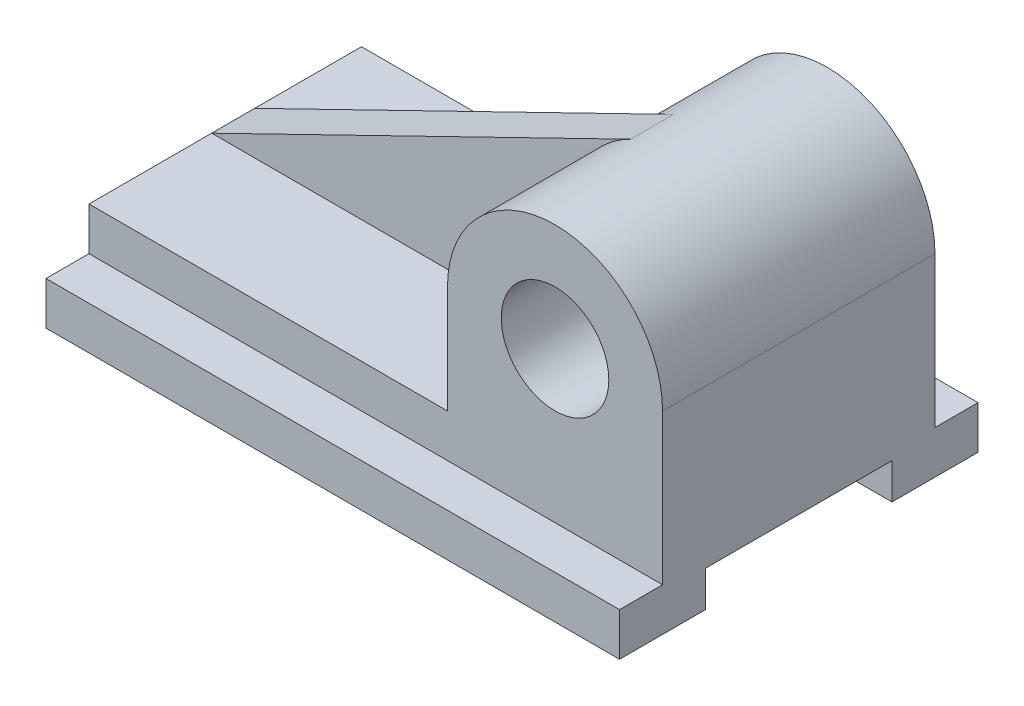
ISO-10303-21;
HEADER;
FILE_DESCRIPTION(('STEP AP214'),'2;1');
FILE_NAME('part.step','',(''),(''),'','','');
FILE_SCHEMA(('AUTOMOTIVE_DESIGN { 1 0 10303 214 1 1 1 1 }'));
ENDSEC;
DATA;
#1=APPLICATION_CONTEXT('core data for automotive mechanical design processes');
#2=APPLICATION_PROTOCOL_DEFINITION('international standard','automotive_design',2000,#1);
#3=PRODUCT_CONTEXT('',#1,'mechanical');
#4=PRODUCT('Part','Part','',(#3));
#5=PRODUCT_RELATED_PRODUCT_CATEGORY('part','',(#4));
#6=PRODUCT_DEFINITION_FORMATION('','',#4);
#7=PRODUCT_DEFINITION_CONTEXT('part definition',#1,'design');
#8=PRODUCT_DEFINITION('design','',#6,#7);
#9=PRODUCT_DEFINITION_SHAPE('','',#8);
#10=(LENGTH_UNIT() NAMED_UNIT(*) SI_UNIT(.MILLI.,.METRE.));
#11=(NAMED_UNIT(*) PLANE_ANGLE_UNIT() SI_UNIT($,.RADIAN.));
#12=(NAMED_UNIT(*) SI_UNIT($,.STERADIAN.) SOLID_ANGLE_UNIT());
#13=UNCERTAINTY_MEASURE_WITH_UNIT(LENGTH_MEASURE(1.E-05),#10,'distance_accuracy_value','');
#14=(GEOMETRIC_REPRESENTATION_CONTEXT(3) GLOBAL_UNCERTAINTY_ASSIGNED_CONTEXT((#13)) GLOBAL_UNIT_ASSIGNED_CONTEXT((#10,
#11,#12)) REPRESENTATION_CONTEXT('',''));
#15=CARTESIAN_POINT('',(0.,0.,0.));
#16=DIRECTION('',(0.,0.,1.));
#17=DIRECTION('',(1.,0.,0.));
#18=AXIS2_PLACEMENT_3D('',#15,#16,#17);
#19=CARTESIAN_POINT('',(160.,24.,-41.7777777777778));
#20=DIRECTION('',(0.,-1.,0.));
#21=DIRECTION('',(0.,0.,-1.));
#22=AXIS2_PLACEMENT_3D('',#19,#20,#21);
#23=PLANE('',#22);
#24=DIRECTION('',(1.,0.,0.));
#25=VECTOR('',#24,1.);
#26=CARTESIAN_POINT('',(0.,24.,0.));
#27=LINE('',#26,#25);
#28=CARTESIAN_POINT('',(0.,24.,0.));
#29=VERTEX_POINT('',#28);
#30=CARTESIAN_POINT('',(100.,24.,0.));
#31=VERTEX_POINT('',#30);
#32=EDGE_CURVE('E196',#29,#31,#27,.T.);
#33=ORIENTED_EDGE('',*,*,#32,.F.);
#34=DIRECTION('',(0.,0.,1.));
#35=VECTOR('',#34,1.);
#36=CARTESIAN_POINT('',(0.,24.,-41.7777777777778));
#37=LINE('',#36,#35);
#38=CARTESIAN_POINT('',(0.,24.,34.2222222222222));
#39=VERTEX_POINT('',#38);
#40=EDGE_CURVE('E295',#29,#39,#37,.T.);
#41=ORIENTED_EDGE('',*,*,#40,.T.);
#42=DIRECTION('',(-1.,0.,0.));
#43=VECTOR('',#42,1.);
#44=CARTESIAN_POINT('',(160.,24.,34.2222222222222));
#45=LINE('',#44,#43);
#46=CARTESIAN_POINT('',(100.,24.,34.2222222222222));
#47=VERTEX_POINT('',#46);
#48=EDGE_CURVE('E347',#47,#39,#45,.T.);
#49=ORIENTED_EDGE('',*,*,#48,.F.);
#50=DIRECTION('',(0.,0.,1.));
#51=VECTOR('',#50,1.);
#52=CARTESIAN_POINT('',(100.,24.,-41.7777777777778));
#53=LINE('',#52,#51);
#54=EDGE_CURVE('E239',#31,#47,#53,.T.);
#55=ORIENTED_EDGE('',*,*,#54,.F.);
#56=EDGE_LOOP('',(#33,#41,#49,#55));
#57=FACE_BOUND('',#56,.T.);
#58=ADVANCED_FACE('F41',(#57),#23,.F.);
#59=CARTESIAN_POINT('',(100.,0.,-41.7777777777778));
#60=DIRECTION('',(-1.,0.,0.));
#61=DIRECTION('',(0.,0.,1.));
#62=AXIS2_PLACEMENT_3D('',#59,#60,#61);
#63=PLANE('',#62);
#64=DIRECTION('',(0.,0.,1.));
#65=VECTOR('',#64,1.);
#66=CARTESIAN_POINT('',(100.,54.,-41.7777777777778));
#67=LINE('',#66,#65);
#68=CARTESIAN_POINT('',(100.,54.,0.));
#69=VERTEX_POINT('',#68);
#70=CARTESIAN_POINT('',(100.,54.,34.2222222222222));
#71=VERTEX_POINT('',#70);
#72=EDGE_CURVE('E242',#69,#71,#67,.T.);
#73=ORIENTED_EDGE('',*,*,#72,.F.);
#74=DIRECTION('',(0.,1.,0.));
#75=VECTOR('',#74,1.);
#76=CARTESIAN_POINT('',(100.,24.,0.));
#77=LINE('',#76,#75);
#78=EDGE_CURVE('E57',#31,#69,#77,.T.);
#79=ORIENTED_EDGE('',*,*,#78,.F.);
#80=ORIENTED_EDGE('',*,*,#54,.T.);
#81=DIRECTION('',(0.,-1.,0.));
#82=VECTOR('',#81,1.);
#83=CARTESIAN_POINT('',(100.,0.,34.2222222222222));
#84=LINE('',#83,#82);
#85=EDGE_CURVE('E218',#71,#47,#84,.T.);
#86=ORIENTED_EDGE('',*,*,#85,.F.);
#87=EDGE_LOOP('',(#73,#79,#80,#86));
#88=FACE_BOUND('',#87,.T.);
#89=ADVANCED_FACE('F429',(#88),#63,.T.);
#90=CARTESIAN_POINT('',(0.,24.,-41.7777777777778));
#91=VERTEX_POINT('',#90);
#92=CARTESIAN_POINT('',(0.,24.,-12.));
#93=VERTEX_POINT('',#92);
#94=EDGE_CURVE('E296',#91,#93,#37,.T.);
#95=ORIENTED_EDGE('',*,*,#94,.T.);
#96=DIRECTION('',(1.,0.,0.));
#97=VECTOR('',#96,1.);
#98=CARTESIAN_POINT('',(0.,24.,-12.));
#99=LINE('',#98,#97);
#100=CARTESIAN_POINT('',(100.,24.,-12.));
#101=VERTEX_POINT('',#100);
#102=EDGE_CURVE('E186',#93,#101,#99,.T.);
#103=ORIENTED_EDGE('',*,*,#102,.T.);
#104=CARTESIAN_POINT('',(100.,24.,-41.7777777777778));
#105=VERTEX_POINT('',#104);
#106=EDGE_CURVE('E65',#105,#101,#53,.T.);
#107=ORIENTED_EDGE('',*,*,#106,.F.);
#108=DIRECTION('',(-1.,0.,0.));
#109=VECTOR('',#108,1.);
#110=CARTESIAN_POINT('',(160.,24.,-41.7777777777778));
#111=LINE('',#110,#109);
#112=EDGE_CURVE('E351',#105,#91,#111,.T.);
#113=ORIENTED_EDGE('',*,*,#112,.T.);
#114=EDGE_LOOP('',(#95,#103,#107,#113));
#115=FACE_BOUND('',#114,.T.);
#116=ADVANCED_FACE('F427',(#115),#23,.F.);
#117=CARTESIAN_POINT('',(160.,0.,-53.7777777777778));
#118=DIRECTION('',(0.,1.,0.));
#119=DIRECTION('',(0.,0.,1.));
#120=AXIS2_PLACEMENT_3D('',#117,#118,#119);
#121=PLANE('',#120);
#122=DIRECTION('',(0.,0.,-1.));
#123=VECTOR('',#122,1.);
#124=CARTESIAN_POINT('',(0.,0.,-53.7777777777778));
#125=LINE('',#124,#123);
#126=CARTESIAN_POINT('',(0.,0.,-29.7777777777778));
#127=VERTEX_POINT('',#126);
#128=CARTESIAN_POINT('',(0.,0.,-53.7777777777778));
#129=VERTEX_POINT('',#128);
#130=EDGE_CURVE('E238',#127,#129,#125,.T.);
#131=ORIENTED_EDGE('',*,*,#130,.T.);
#132=DIRECTION('',(-1.,0.,0.));
#133=VECTOR('',#132,1.);
#134=CARTESIAN_POINT('',(160.,0.,-53.7777777777778));
#135=LINE('',#134,#133);
#136=CARTESIAN_POINT('',(160.,0.,-53.7777777777778));
#137=VERTEX_POINT('',#136);
#138=EDGE_CURVE('E11',#137,#129,#135,.T.);
#139=ORIENTED_EDGE('',*,*,#138,.F.);
#140=DIRECTION('',(0.,0.,-1.));
#141=VECTOR('',#140,1.);
#142=CARTESIAN_POINT('',(160.,0.,-53.7777777777778));
#143=LINE('',#142,#141);
#144=CARTESIAN_POINT('',(160.,0.,-29.7777777777778));
#145=VERTEX_POINT('',#144);
#146=EDGE_CURVE('E246',#145,#137,#143,.T.);
#147=ORIENTED_EDGE('',*,*,#146,.F.);
#148=DIRECTION('',(-1.,0.,0.));
#149=VECTOR('',#148,1.);
#150=CARTESIAN_POINT('',(160.,0.,-29.7777777777778));
#151=LINE('',#150,#149);
#152=EDGE_CURVE('E281',#145,#127,#151,.T.);
#153=ORIENTED_EDGE('',*,*,#152,.T.);
#154=EDGE_LOOP('',(#131,#139,#147,#153));
#155=FACE_BOUND('',#154,.T.);
#156=ADVANCED_FACE('F43',(#155),#121,.F.);
#157=CARTESIAN_POINT('',(160.,0.,-53.7777777777778));
#158=DIRECTION('',(0.,0.,1.));
#159=DIRECTION('',(1.,0.,0.));
#160=AXIS2_PLACEMENT_3D('',#157,#158,#159);
#161=PLANE('',#160);
#162=DIRECTION('',(0.,1.,0.));
#163=VECTOR('',#162,1.);
#164=CARTESIAN_POINT('',(0.,0.,-53.7777777777778));
#165=LINE('',#164,#163);
#166=CARTESIAN_POINT('',(0.,12.,-53.7777777777778));
#167=VERTEX_POINT('',#166);
#168=EDGE_CURVE('E285',#129,#167,#165,.T.);
#169=ORIENTED_EDGE('',*,*,#168,.T.);
#170=DIRECTION('',(-1.,0.,0.));
#171=VECTOR('',#170,1.);
#172=CARTESIAN_POINT('',(160.,12.,-53.7777777777778));
#173=LINE('',#172,#171);
#174=CARTESIAN_POINT('',(160.,12.,-53.7777777777778));
#175=VERTEX_POINT('',#174);
#176=EDGE_CURVE('E50',#175,#167,#173,.T.);
#177=ORIENTED_EDGE('',*,*,#176,.F.);
#178=DIRECTION('',(0.,1.,0.));
#179=VECTOR('',#178,1.);
#180=CARTESIAN_POINT('',(160.,0.,-53.7777777777778));
#181=LINE('',#180,#179);
#182=EDGE_CURVE('E250',#137,#175,#181,.T.);
#183=ORIENTED_EDGE('',*,*,#182,.F.);
#184=ORIENTED_EDGE('',*,*,#138,.T.);
#185=EDGE_LOOP('',(#169,#177,#183,#184));
#186=FACE_BOUND('',#185,.T.);
#187=ADVANCED_FACE('F420',(#186),#161,.F.);
#188=CARTESIAN_POINT('',(160.,12.,-53.7777777777778));
#189=DIRECTION('',(0.,-1.,0.));
#190=DIRECTION('',(0.,0.,-1.));
#191=AXIS2_PLACEMENT_3D('',#188,#189,#190);
#192=PLANE('',#191);
#193=DIRECTION('',(0.,0.,1.));
#194=VECTOR('',#193,1.);
#195=CARTESIAN_POINT('',(0.,12.,-53.7777777777778));
#196=LINE('',#195,#194);
#197=CARTESIAN_POINT('',(0.,12.,-41.7777777777778));
#198=VERTEX_POINT('',#197);
#199=EDGE_CURVE('E288',#167,#198,#196,.T.);
#200=ORIENTED_EDGE('',*,*,#199,.T.);
#201=DIRECTION('',(-1.,0.,0.));
#202=VECTOR('',#201,1.);
#203=CARTESIAN_POINT('',(160.,12.,-41.7777777777778));
#204=LINE('',#203,#202);
#205=CARTESIAN_POINT('',(160.,12.,-41.7777777777778));
#206=VERTEX_POINT('',#205);
#207=EDGE_CURVE('E354',#206,#198,#204,.T.);
#208=ORIENTED_EDGE('',*,*,#207,.F.);
#209=DIRECTION('',(0.,0.,1.));
#210=VECTOR('',#209,1.);
#211=CARTESIAN_POINT('',(160.,12.,-53.7777777777778));
#212=LINE('',#211,#210);
#213=EDGE_CURVE('E254',#175,#206,#212,.T.);
#214=ORIENTED_EDGE('',*,*,#213,.F.);
#215=ORIENTED_EDGE('',*,*,#176,.T.);
#216=EDGE_LOOP('',(#200,#208,#214,#215));
#217=FACE_BOUND('',#216,.T.);
#218=ADVANCED_FACE('F363',(#217),#192,.F.);
#219=CARTESIAN_POINT('',(160.,12.,-41.7777777777778));
#220=DIRECTION('',(0.,0.,1.));
#221=DIRECTION('',(1.,0.,0.));
#222=AXIS2_PLACEMENT_3D('',#219,#220,#221);
#223=PLANE('',#222);
#224=DIRECTION('',(0.,1.,0.));
#225=VECTOR('',#224,1.);
#226=CARTESIAN_POINT('',(0.,12.,-41.7777777777778));
#227=LINE('',#226,#225);
#228=EDGE_CURVE('E291',#198,#91,#227,.T.);
#229=ORIENTED_EDGE('',*,*,#228,.T.);
#230=ORIENTED_EDGE('',*,*,#112,.F.);
#231=DIRECTION('',(0.,-1.,0.));
#232=VECTOR('',#231,1.);
#233=CARTESIAN_POINT('',(100.,0.,-41.7777777777778));
#234=LINE('',#233,#232);
#235=CARTESIAN_POINT('',(100.,54.,-41.7777777777778));
#236=VERTEX_POINT('',#235);
#237=EDGE_CURVE('E221',#236,#105,#234,.T.);
#238=ORIENTED_EDGE('',*,*,#237,.F.);
#239=CARTESIAN_POINT('',(130.,54.,-41.7777777777778));
#240=DIRECTION('',(0.,0.,1.));
#241=DIRECTION('',(1.,0.,0.));
#242=AXIS2_PLACEMENT_3D('',#239,#240,#241);
#243=CIRCLE('',#242,30.);
#244=CARTESIAN_POINT('',(160.,54.,-41.7777777777778));
#245=VERTEX_POINT('',#244);
#246=EDGE_CURVE('E217',#245,#236,#243,.T.);
#247=ORIENTED_EDGE('',*,*,#246,.F.);
#248=DIRECTION('',(0.,1.,0.));
#249=VECTOR('',#248,1.);
#250=CARTESIAN_POINT('',(160.,12.,-41.7777777777778));
#251=LINE('',#250,#249);
#252=EDGE_CURVE('E257',#206,#245,#251,.T.);
#253=ORIENTED_EDGE('',*,*,#252,.F.);
#254=ORIENTED_EDGE('',*,*,#207,.T.);
#255=EDGE_LOOP('',(#229,#230,#238,#247,#253,#254));
#256=FACE_BOUND('',#255,.T.);
#257=CARTESIAN_POINT('',(130.,54.,-41.7777777777778));
#258=DIRECTION('',(0.,0.,1.));
#259=DIRECTION('',(1.,0.,0.));
#260=AXIS2_PLACEMENT_3D('',#257,#258,#259);
#261=CIRCLE('',#260,15.);
#262=CARTESIAN_POINT('',(145.,54.,-41.7777777777778));
#263=VERTEX_POINT('',#262);
#264=EDGE_CURVE('E213',#263,#263,#261,.T.);
#265=ORIENTED_EDGE('',*,*,#264,.T.);
#266=EDGE_LOOP('',(#265));
#267=FACE_BOUND('',#266,.T.);
#268=ADVANCED_FACE('F372',(#256,#267),#223,.F.);
#269=CARTESIAN_POINT('',(160.,24.,34.2222222222222));
#270=DIRECTION('',(0.,0.,-1.));
#271=DIRECTION('',(-1.,0.,0.));
#272=AXIS2_PLACEMENT_3D('',#269,#270,#271);
#273=PLANE('',#272);
#274=DIRECTION('',(0.,-1.,0.));
#275=VECTOR('',#274,1.);
#276=CARTESIAN_POINT('',(0.,24.,34.2222222222222));
#277=LINE('',#276,#275);
#278=CARTESIAN_POINT('',(0.,12.,34.2222222222222));
#279=VERTEX_POINT('',#278);
#280=EDGE_CURVE('E300',#39,#279,#277,.T.);
#281=ORIENTED_EDGE('',*,*,#280,.T.);
#282=DIRECTION('',(-1.,0.,0.));
#283=VECTOR('',#282,1.);
#284=CARTESIAN_POINT('',(160.,12.,34.2222222222222));
#285=LINE('',#284,#283);
#286=CARTESIAN_POINT('',(160.,12.,34.2222222222222));
#287=VERTEX_POINT('',#286);
#288=EDGE_CURVE('E343',#287,#279,#285,.T.);
#289=ORIENTED_EDGE('',*,*,#288,.F.);
#290=DIRECTION('',(0.,-1.,0.));
#291=VECTOR('',#290,1.);
#292=CARTESIAN_POINT('',(160.,24.,34.2222222222222));
#293=LINE('',#292,#291);
#294=CARTESIAN_POINT('',(160.,54.,34.2222222222222));
#295=VERTEX_POINT('',#294);
#296=EDGE_CURVE('E260',#295,#287,#293,.T.);
#297=ORIENTED_EDGE('',*,*,#296,.F.);
#298=CARTESIAN_POINT('',(130.,54.,34.2222222222222));
#299=DIRECTION('',(0.,0.,1.));
#300=DIRECTION('',(1.,0.,0.));
#301=AXIS2_PLACEMENT_3D('',#298,#299,#300);
#302=CIRCLE('',#301,30.);
#303=EDGE_CURVE('E229',#295,#71,#302,.T.);
#304=ORIENTED_EDGE('',*,*,#303,.T.);
#305=ORIENTED_EDGE('',*,*,#85,.T.);
#306=ORIENTED_EDGE('',*,*,#48,.T.);
#307=EDGE_LOOP('',(#281,#289,#297,#304,#305,#306));
#308=FACE_BOUND('',#307,.T.);
#309=CARTESIAN_POINT('',(130.,54.,34.2222222222222));
#310=DIRECTION('',(0.,0.,1.));
#311=DIRECTION('',(1.,0.,0.));
#312=AXIS2_PLACEMENT_3D('',#309,#310,#311);
#313=CIRCLE('',#312,15.);
#314=CARTESIAN_POINT('',(145.,54.,34.2222222222222));
#315=VERTEX_POINT('',#314);
#316=EDGE_CURVE('E211',#315,#315,#313,.T.);
#317=ORIENTED_EDGE('',*,*,#316,.F.);
#318=EDGE_LOOP('',(#317));
#319=FACE_BOUND('',#318,.T.);
#320=ADVANCED_FACE('F384',(#308,#319),#273,.F.);
#321=CARTESIAN_POINT('',(160.,12.,34.2222222222222));
#322=DIRECTION('',(0.,-1.,0.));
#323=DIRECTION('',(0.,0.,-1.));
#324=AXIS2_PLACEMENT_3D('',#321,#322,#323);
#325=PLANE('',#324);
#326=DIRECTION('',(0.,0.,1.));
#327=VECTOR('',#326,1.);
#328=CARTESIAN_POINT('',(0.,12.,34.2222222222222));
#329=LINE('',#328,#327);
#330=CARTESIAN_POINT('',(0.,12.,46.2222222222222));
#331=VERTEX_POINT('',#330);
#332=EDGE_CURVE('E303',#279,#331,#329,.T.);
#333=ORIENTED_EDGE('',*,*,#332,.T.);
#334=DIRECTION('',(-1.,0.,0.));
#335=VECTOR('',#334,1.);
#336=CARTESIAN_POINT('',(160.,12.,46.2222222222222));
#337=LINE('',#336,#335);
#338=CARTESIAN_POINT('',(160.,12.,46.2222222222222));
#339=VERTEX_POINT('',#338);
#340=EDGE_CURVE('E339',#339,#331,#337,.T.);
#341=ORIENTED_EDGE('',*,*,#340,.F.);
#342=DIRECTION('',(0.,0.,1.));
#343=VECTOR('',#342,1.);
#344=CARTESIAN_POINT('',(160.,12.,34.2222222222222));
#345=LINE('',#344,#343);
#346=EDGE_CURVE('E263',#287,#339,#345,.T.);
#347=ORIENTED_EDGE('',*,*,#346,.F.);
#348=ORIENTED_EDGE('',*,*,#288,.T.);
#349=EDGE_LOOP('',(#333,#341,#347,#348));
#350=FACE_BOUND('',#349,.T.);
#351=ADVANCED_FACE('F392',(#350),#325,.F.);
#352=CARTESIAN_POINT('',(160.,12.,46.2222222222222));
#353=DIRECTION('',(0.,0.,-1.));
#354=DIRECTION('',(-1.,0.,0.));
#355=AXIS2_PLACEMENT_3D('',#352,#353,#354);
#356=PLANE('',#355);
#357=DIRECTION('',(0.,-1.,0.));
#358=VECTOR('',#357,1.);
#359=CARTESIAN_POINT('',(0.,12.,46.2222222222222));
#360=LINE('',#359,#358);
#361=CARTESIAN_POINT('',(0.,0.,46.2222222222222));
#362=VERTEX_POINT('',#361);
#363=EDGE_CURVE('E306',#331,#362,#360,.T.);
#364=ORIENTED_EDGE('',*,*,#363,.T.);
#365=DIRECTION('',(-1.,0.,0.));
#366=VECTOR('',#365,1.);
#367=CARTESIAN_POINT('',(160.,0.,46.2222222222222));
#368=LINE('',#367,#366);
#369=CARTESIAN_POINT('',(160.,0.,46.2222222222222));
#370=VERTEX_POINT('',#369);
#371=EDGE_CURVE('E335',#370,#362,#368,.T.);
#372=ORIENTED_EDGE('',*,*,#371,.F.);
#373=DIRECTION('',(0.,-1.,0.));
#374=VECTOR('',#373,1.);
#375=CARTESIAN_POINT('',(160.,12.,46.2222222222222));
#376=LINE('',#375,#374);
#377=EDGE_CURVE('E266',#339,#370,#376,.T.);
#378=ORIENTED_EDGE('',*,*,#377,.F.);
#379=ORIENTED_EDGE('',*,*,#340,.T.);
#380=EDGE_LOOP('',(#364,#372,#378,#379));
#381=FACE_BOUND('',#380,.T.);
#382=ADVANCED_FACE('F396',(#381),#356,.F.);
#383=CARTESIAN_POINT('',(160.,0.,22.2222222222222));
#384=DIRECTION('',(0.,1.,0.));
#385=DIRECTION('',(0.,0.,1.));
#386=AXIS2_PLACEMENT_3D('',#383,#384,#385);
#387=PLANE('',#386);
#388=DIRECTION('',(0.,0.,-1.));
#389=VECTOR('',#388,1.);
#390=CARTESIAN_POINT('',(0.,0.,22.2222222222222));
#391=LINE('',#390,#389);
#392=CARTESIAN_POINT('',(0.,0.,22.2222222222222));
#393=VERTEX_POINT('',#392);
#394=EDGE_CURVE('E309',#362,#393,#391,.T.);
#395=ORIENTED_EDGE('',*,*,#394,.T.);
#396=DIRECTION('',(-1.,0.,0.));
#397=VECTOR('',#396,1.);
#398=CARTESIAN_POINT('',(160.,0.,22.2222222222222));
#399=LINE('',#398,#397);
#400=CARTESIAN_POINT('',(160.,0.,22.2222222222222));
#401=VERTEX_POINT('',#400);
#402=EDGE_CURVE('E331',#401,#393,#399,.T.);
#403=ORIENTED_EDGE('',*,*,#402,.F.);
#404=DIRECTION('',(0.,0.,-1.));
#405=VECTOR('',#404,1.);
#406=CARTESIAN_POINT('',(160.,0.,22.2222222222222));
#407=LINE('',#406,#405);
#408=EDGE_CURVE('E269',#370,#401,#407,.T.);
#409=ORIENTED_EDGE('',*,*,#408,.F.);
#410=ORIENTED_EDGE('',*,*,#371,.T.);
#411=EDGE_LOOP('',(#395,#403,#409,#410));
#412=FACE_BOUND('',#411,.T.);
#413=ADVANCED_FACE('F401',(#412),#387,.F.);
#414=CARTESIAN_POINT('',(160.,9.99999999999999,22.2222222222222));
#415=DIRECTION('',(0.,0.,1.));
#416=DIRECTION('',(0.,-1.,0.));
#417=AXIS2_PLACEMENT_3D('',#414,#415,#416);
#418=PLANE('',#417);
#419=DIRECTION('',(0.,1.,0.));
#420=VECTOR('',#419,1.);
#421=CARTESIAN_POINT('',(0.,9.99999999999999,22.2222222222222));
#422=LINE('',#421,#420);
#423=CARTESIAN_POINT('',(0.,9.99999999999999,22.2222222222222));
#424=VERTEX_POINT('',#423);
#425=EDGE_CURVE('E312',#393,#424,#422,.T.);
#426=ORIENTED_EDGE('',*,*,#425,.T.);
#427=DIRECTION('',(-1.,0.,0.));
#428=VECTOR('',#427,1.);
#429=CARTESIAN_POINT('',(160.,9.99999999999999,22.2222222222222));
#430=LINE('',#429,#428);
#431=CARTESIAN_POINT('',(160.,9.99999999999999,22.2222222222222));
#432=VERTEX_POINT('',#431);
#433=EDGE_CURVE('E327',#432,#424,#430,.T.);
#434=ORIENTED_EDGE('',*,*,#433,.F.);
#435=DIRECTION('',(0.,1.,0.));
#436=VECTOR('',#435,1.);
#437=CARTESIAN_POINT('',(160.,9.99999999999999,22.2222222222222));
#438=LINE('',#437,#436);
#439=EDGE_CURVE('E272',#401,#432,#438,.T.);
#440=ORIENTED_EDGE('',*,*,#439,.F.);
#441=ORIENTED_EDGE('',*,*,#402,.T.);
#442=EDGE_LOOP('',(#426,#434,#440,#441));
#443=FACE_BOUND('',#442,.T.);
#444=ADVANCED_FACE('F407',(#443),#418,.F.);
#445=CARTESIAN_POINT('',(160.,10.,-29.7777777777778));
#446=DIRECTION('',(0.,1.,0.));
#447=DIRECTION('',(0.,0.,1.));
#448=AXIS2_PLACEMENT_3D('',#445,#446,#447);
#449=PLANE('',#448);
#450=DIRECTION('',(0.,0.,-1.));
#451=VECTOR('',#450,1.);
#452=CARTESIAN_POINT('',(0.,10.,-29.7777777777778));
#453=LINE('',#452,#451);
#454=CARTESIAN_POINT('',(0.,10.,-29.7777777777778));
#455=VERTEX_POINT('',#454);
#456=EDGE_CURVE('E315',#424,#455,#453,.T.);
#457=ORIENTED_EDGE('',*,*,#456,.T.);
#458=DIRECTION('',(-1.,0.,0.));
#459=VECTOR('',#458,1.);
#460=CARTESIAN_POINT('',(160.,10.,-29.7777777777778));
#461=LINE('',#460,#459);
#462=CARTESIAN_POINT('',(160.,10.,-29.7777777777778));
#463=VERTEX_POINT('',#462);
#464=EDGE_CURVE('E323',#463,#455,#461,.T.);
#465=ORIENTED_EDGE('',*,*,#464,.F.);
#466=DIRECTION('',(0.,0.,-1.));
#467=VECTOR('',#466,1.);
#468=CARTESIAN_POINT('',(160.,10.,-29.7777777777778));
#469=LINE('',#468,#467);
#470=EDGE_CURVE('E275',#432,#463,#469,.T.);
#471=ORIENTED_EDGE('',*,*,#470,.F.);
#472=ORIENTED_EDGE('',*,*,#433,.T.);
#473=EDGE_LOOP('',(#457,#465,#471,#472));
#474=FACE_BOUND('',#473,.T.);
#475=ADVANCED_FACE('F411',(#474),#449,.F.);
#476=CARTESIAN_POINT('',(160.,0.,-29.7777777777778));
#477=DIRECTION('',(0.,0.,-1.));
#478=DIRECTION('',(-1.,0.,0.));
#479=AXIS2_PLACEMENT_3D('',#476,#477,#478);
#480=PLANE('',#479);
#481=DIRECTION('',(0.,-1.,0.));
#482=VECTOR('',#481,1.);
#483=CARTESIAN_POINT('',(0.,0.,-29.7777777777778));
#484=LINE('',#483,#482);
#485=EDGE_CURVE('E251',#455,#127,#484,.T.);
#486=ORIENTED_EDGE('',*,*,#485,.T.);
#487=ORIENTED_EDGE('',*,*,#152,.F.);
#488=DIRECTION('',(0.,-1.,0.));
#489=VECTOR('',#488,1.);
#490=CARTESIAN_POINT('',(160.,0.,-29.7777777777778));
#491=LINE('',#490,#489);
#492=EDGE_CURVE('E278',#463,#145,#491,.T.);
#493=ORIENTED_EDGE('',*,*,#492,.F.);
#494=ORIENTED_EDGE('',*,*,#464,.T.);
#495=EDGE_LOOP('',(#486,#487,#493,#494));
#496=FACE_BOUND('',#495,.T.);
#497=ADVANCED_FACE('F416',(#496),#480,.F.);
#498=CARTESIAN_POINT('',(160.,0.,0.));
#499=DIRECTION('',(-1.,0.,0.));
#500=DIRECTION('',(0.,0.,1.));
#501=AXIS2_PLACEMENT_3D('',#498,#499,#500);
#502=PLANE('',#501);
#503=ORIENTED_EDGE('',*,*,#146,.T.);
#504=ORIENTED_EDGE('',*,*,#182,.T.);
#505=ORIENTED_EDGE('',*,*,#213,.T.);
#506=ORIENTED_EDGE('',*,*,#252,.T.);
#507=DIRECTION('',(0.,0.,1.));
#508=VECTOR('',#507,1.);
#509=CARTESIAN_POINT('',(160.,54.,-41.7777777777778));
#510=LINE('',#509,#508);
#511=EDGE_CURVE('E225',#245,#295,#510,.T.);
#512=ORIENTED_EDGE('',*,*,#511,.T.);
#513=ORIENTED_EDGE('',*,*,#296,.T.);
#514=ORIENTED_EDGE('',*,*,#346,.T.);
#515=ORIENTED_EDGE('',*,*,#377,.T.);
#516=ORIENTED_EDGE('',*,*,#408,.T.);
#517=ORIENTED_EDGE('',*,*,#439,.T.);
#518=ORIENTED_EDGE('',*,*,#470,.T.);
#519=ORIENTED_EDGE('',*,*,#492,.T.);
#520=EDGE_LOOP('',(#503,#504,#505,#506,#512,#513,#514,#515,#516,#517,#518,#519));
#521=FACE_BOUND('',#520,.T.);
#522=ADVANCED_FACE('F379',(#521),#502,.F.);
#523=CARTESIAN_POINT('',(0.,0.,0.));
#524=DIRECTION('',(-1.,0.,0.));
#525=DIRECTION('',(0.,0.,1.));
#526=AXIS2_PLACEMENT_3D('',#523,#524,#525);
#527=PLANE('',#526);
#528=ORIENTED_EDGE('',*,*,#130,.F.);
#529=ORIENTED_EDGE('',*,*,#485,.F.);
#530=ORIENTED_EDGE('',*,*,#456,.F.);
#531=ORIENTED_EDGE('',*,*,#425,.F.);
#532=ORIENTED_EDGE('',*,*,#394,.F.);
#533=ORIENTED_EDGE('',*,*,#363,.F.);
#534=ORIENTED_EDGE('',*,*,#332,.F.);
#535=ORIENTED_EDGE('',*,*,#280,.F.);
#536=ORIENTED_EDGE('',*,*,#40,.F.);
#537=DIRECTION('',(0.,0.,1.));
#538=VECTOR('',#537,1.);
#539=CARTESIAN_POINT('',(0.,24.,-12.));
#540=LINE('',#539,#538);
#541=EDGE_CURVE('E179',#93,#29,#540,.T.);
#542=ORIENTED_EDGE('',*,*,#541,.F.);
#543=ORIENTED_EDGE('',*,*,#94,.F.);
#544=ORIENTED_EDGE('',*,*,#228,.F.);
#545=ORIENTED_EDGE('',*,*,#199,.F.);
#546=ORIENTED_EDGE('',*,*,#168,.F.);
#547=EDGE_LOOP('',(#528,#529,#530,#531,#532,#533,#534,#535,#536,#542,#543,#544,#545,#546));
#548=FACE_BOUND('',#547,.T.);
#549=ADVANCED_FACE('F369',(#548),#527,.T.);
#550=DIRECTION('',(0.,1.,0.));
#551=VECTOR('',#550,1.);
#552=CARTESIAN_POINT('',(100.,24.,-12.));
#553=LINE('',#552,#551);
#554=CARTESIAN_POINT('',(100.,54.,-12.));
#555=VERTEX_POINT('',#554);
#556=EDGE_CURVE('E180',#101,#555,#553,.T.);
#557=ORIENTED_EDGE('',*,*,#556,.T.);
#558=EDGE_CURVE('E192',#236,#555,#67,.T.);
#559=ORIENTED_EDGE('',*,*,#558,.F.);
#560=ORIENTED_EDGE('',*,*,#237,.T.);
#561=ORIENTED_EDGE('',*,*,#106,.T.);
#562=EDGE_LOOP('',(#557,#559,#560,#561));
#563=FACE_BOUND('',#562,.T.);
#564=ADVANCED_FACE('F437',(#563),#63,.T.);
#565=CARTESIAN_POINT('',(130.,54.,-41.7777777777778));
#566=DIRECTION('',(0.,0.,1.));
#567=DIRECTION('',(1.,0.,0.));
#568=AXIS2_PLACEMENT_3D('',#565,#566,#567);
#569=CYLINDRICAL_SURFACE('',#568,15.);
#570=ORIENTED_EDGE('',*,*,#264,.F.);
#571=EDGE_LOOP('',(#570));
#572=FACE_BOUND('',#571,.T.);
#573=ORIENTED_EDGE('',*,*,#316,.T.);
#574=EDGE_LOOP('',(#573));
#575=FACE_BOUND('',#574,.T.);
#576=ADVANCED_FACE('F446',(#572,#575),#569,.F.);
#577=CARTESIAN_POINT('',(130.,54.,-41.7777777777778));
#578=DIRECTION('',(0.,0.,1.));
#579=DIRECTION('',(1.,0.,0.));
#580=AXIS2_PLACEMENT_3D('',#577,#578,#579);
#581=CYLINDRICAL_SURFACE('',#580,30.);
#582=CARTESIAN_POINT('',(130.,54.,-12.));
#583=DIRECTION('',(0.,0.,-1.));
#584=DIRECTION('',(-1.,0.,0.));
#585=AXIS2_PLACEMENT_3D('',#582,#583,#584);
#586=CIRCLE('',#585,30.);
#587=CARTESIAN_POINT('',(116.85393258427,80.9662921348314,-12.));
#588=VERTEX_POINT('',#587);
#589=EDGE_CURVE('E184',#555,#588,#586,.T.);
#590=ORIENTED_EDGE('',*,*,#589,.T.);
#591=DIRECTION('',(0.,0.,1.));
#592=VECTOR('',#591,1.);
#593=CARTESIAN_POINT('',(116.85393258427,80.9662921348314,-12.));
#594=LINE('',#593,#592);
#595=CARTESIAN_POINT('',(116.85393258427,80.9662921348314,0.));
#596=VERTEX_POINT('',#595);
#597=EDGE_CURVE('E169',#588,#596,#594,.T.);
#598=ORIENTED_EDGE('',*,*,#597,.T.);
#599=CARTESIAN_POINT('',(130.,54.,0.));
#600=DIRECTION('',(0.,0.,-1.));
#601=DIRECTION('',(-1.,0.,0.));
#602=AXIS2_PLACEMENT_3D('',#599,#600,#601);
#603=CIRCLE('',#602,30.);
#604=EDGE_CURVE('E203',#69,#596,#603,.T.);
#605=ORIENTED_EDGE('',*,*,#604,.F.);
#606=ORIENTED_EDGE('',*,*,#72,.T.);
#607=ORIENTED_EDGE('',*,*,#303,.F.);
#608=ORIENTED_EDGE('',*,*,#511,.F.);
#609=ORIENTED_EDGE('',*,*,#246,.T.);
#610=ORIENTED_EDGE('',*,*,#558,.T.);
#611=EDGE_LOOP('',(#590,#598,#605,#606,#607,#608,#609,#610));
#612=FACE_BOUND('',#611,.T.);
#613=ADVANCED_FACE('F190',(#612),#581,.T.);
#614=CARTESIAN_POINT('',(116.85393258427,80.9662921348314,-12.));
#615=DIRECTION('',(-0.438202247191011,0.898876404494382,0.));
#616=DIRECTION('',(-0.898876404494382,-0.438202247191011,0.));
#617=AXIS2_PLACEMENT_3D('',#614,#615,#616);
#618=PLANE('',#617);
#619=DIRECTION('',(-0.898876404494382,-0.438202247191011,0.));
#620=VECTOR('',#619,1.);
#621=CARTESIAN_POINT('',(116.85393258427,80.9662921348314,0.));
#622=LINE('',#621,#620);
#623=EDGE_CURVE('E175',#596,#29,#622,.T.);
#624=ORIENTED_EDGE('',*,*,#623,.F.);
#625=ORIENTED_EDGE('',*,*,#597,.F.);
#626=DIRECTION('',(-0.898876404494382,-0.438202247191011,0.));
#627=VECTOR('',#626,1.);
#628=CARTESIAN_POINT('',(116.85393258427,80.9662921348314,-12.));
#629=LINE('',#628,#627);
#630=EDGE_CURVE('E172',#588,#93,#629,.T.);
#631=ORIENTED_EDGE('',*,*,#630,.T.);
#632=ORIENTED_EDGE('',*,*,#541,.T.);
#633=EDGE_LOOP('',(#624,#625,#631,#632));
#634=FACE_BOUND('',#633,.T.);
#635=ADVANCED_FACE('F171',(#634),#618,.T.);
#636=CARTESIAN_POINT('',(130.,54.,-12.));
#637=DIRECTION('',(0.,0.,-1.));
#638=DIRECTION('',(-1.,0.,0.));
#639=AXIS2_PLACEMENT_3D('',#636,#637,#638);
#640=PLANE('',#639);
#641=ORIENTED_EDGE('',*,*,#589,.F.);
#642=ORIENTED_EDGE('',*,*,#556,.F.);
#643=ORIENTED_EDGE('',*,*,#102,.F.);
#644=ORIENTED_EDGE('',*,*,#630,.F.);
#645=EDGE_LOOP('',(#641,#642,#643,#644));
#646=FACE_BOUND('',#645,.T.);
#647=ADVANCED_FACE('F183',(#646),#640,.T.);
#648=CARTESIAN_POINT('',(130.,54.,0.));
#649=DIRECTION('',(0.,0.,-1.));
#650=DIRECTION('',(-1.,0.,0.));
#651=AXIS2_PLACEMENT_3D('',#648,#649,#650);
#652=PLANE('',#651);
#653=ORIENTED_EDGE('',*,*,#604,.T.);
#654=ORIENTED_EDGE('',*,*,#623,.T.);
#655=ORIENTED_EDGE('',*,*,#32,.T.);
#656=ORIENTED_EDGE('',*,*,#78,.T.);
#657=EDGE_LOOP('',(#653,#654,#655,#656));
#658=FACE_BOUND('',#657,.T.);
#659=ADVANCED_FACE('F567',(#658),#652,.F.);
#660=CLOSED_SHELL('',(#58,#89,#116,#156,#187,#218,#268,#320,#351,#382,#413,#444,#475,#497,#522,
#549,#564,#576,#613,#635,#647,#659));
#661=MANIFOLD_SOLID_BREP('B2',#660);
#662=ADVANCED_BREP_SHAPE_REPRESENTATION('',(#18,#661),#14);
#663=SHAPE_DEFINITION_REPRESENTATION(#9,#662);
ENDSEC;
END-ISO-10303-21;
